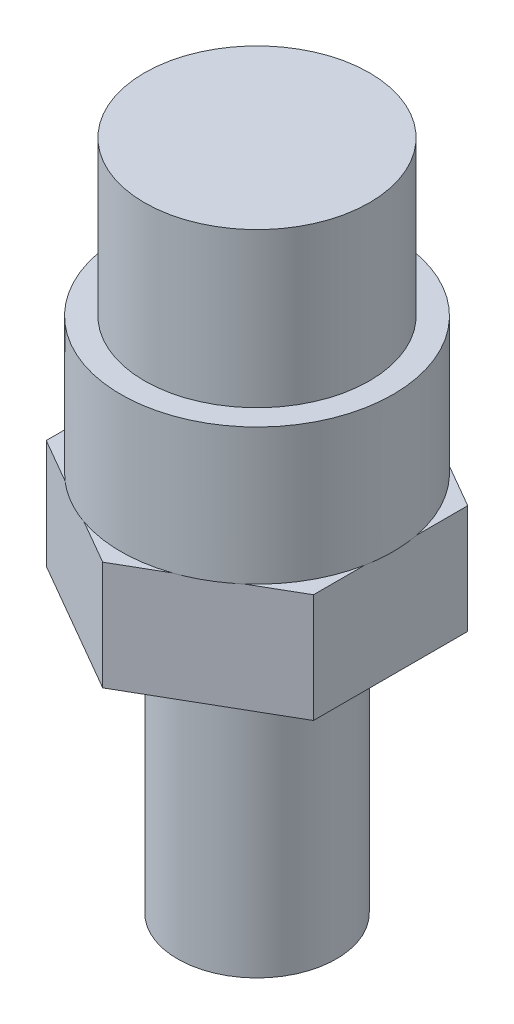
ISO-10303-21;
HEADER;
FILE_DESCRIPTION(('STEP AP214'),'2;1');
FILE_NAME('part.step','',(''),(''),'','','');
FILE_SCHEMA(('AUTOMOTIVE_DESIGN { 1 0 10303 214 1 1 1 1 }'));
ENDSEC;
DATA;
#1=APPLICATION_CONTEXT('core data for automotive mechanical design processes');
#2=APPLICATION_PROTOCOL_DEFINITION('international standard','automotive_design',2000,#1);
#3=PRODUCT_CONTEXT('',#1,'mechanical');
#4=PRODUCT('Part','Part','',(#3));
#5=PRODUCT_RELATED_PRODUCT_CATEGORY('part','',(#4));
#6=PRODUCT_DEFINITION_FORMATION('','',#4);
#7=PRODUCT_DEFINITION_CONTEXT('part definition',#1,'design');
#8=PRODUCT_DEFINITION('design','',#6,#7);
#9=PRODUCT_DEFINITION_SHAPE('','',#8);
#10=(LENGTH_UNIT() NAMED_UNIT(*) SI_UNIT(.MILLI.,.METRE.));
#11=(NAMED_UNIT(*) PLANE_ANGLE_UNIT() SI_UNIT($,.RADIAN.));
#12=(NAMED_UNIT(*) SI_UNIT($,.STERADIAN.) SOLID_ANGLE_UNIT());
#13=UNCERTAINTY_MEASURE_WITH_UNIT(LENGTH_MEASURE(1.E-05),#10,'distance_accuracy_value','');
#14=(GEOMETRIC_REPRESENTATION_CONTEXT(3) GLOBAL_UNCERTAINTY_ASSIGNED_CONTEXT((#13)) GLOBAL_UNIT_ASSIGNED_CONTEXT((#10,
#11,#12)) REPRESENTATION_CONTEXT('',''));
#15=CARTESIAN_POINT('',(0.,0.,0.));
#16=DIRECTION('',(0.,0.,1.));
#17=DIRECTION('',(1.,0.,0.));
#18=AXIS2_PLACEMENT_3D('',#15,#16,#17);
#19=CARTESIAN_POINT('',(5.55625000000001,19.05,0.));
#20=DIRECTION('',(0.,1.,0.));
#21=DIRECTION('',(-1.,0.,0.));
#22=AXIS2_PLACEMENT_3D('',#19,#20,#21);
#23=PLANE('',#22);
#24=CARTESIAN_POINT('',(0.,19.05,0.));
#25=DIRECTION('',(0.,1.,0.));
#26=DIRECTION('',(-1.,0.,0.));
#27=AXIS2_PLACEMENT_3D('',#24,#25,#26);
#28=CIRCLE('',#27,5.55625000000001);
#29=CARTESIAN_POINT('',(-5.55625000000001,19.05,0.));
#30=VERTEX_POINT('',#29);
#31=EDGE_CURVE('E68',#30,#30,#28,.T.);
#32=ORIENTED_EDGE('',*,*,#31,.T.);
#33=EDGE_LOOP('',(#32));
#34=FACE_BOUND('',#33,.T.);
#35=DIRECTION('',(0.,0.,-1.));
#36=VECTOR('',#35,1.);
#37=CARTESIAN_POINT('',(-9.34874423385302,19.05,0.));
#38=LINE('',#37,#36);
#39=CARTESIAN_POINT('',(-9.34874423385302,19.05,5.3975));
#40=VERTEX_POINT('',#39);
#41=CARTESIAN_POINT('',(-9.34874423385302,19.05,-5.3975));
#42=VERTEX_POINT('',#41);
#43=EDGE_CURVE('E150',#40,#42,#38,.T.);
#44=ORIENTED_EDGE('',*,*,#43,.T.);
#45=DIRECTION('',(0.866025403784439,0.,-0.5));
#46=VECTOR('',#45,1.);
#47=CARTESIAN_POINT('',(-4.67437211692651,19.05,-8.09625));
#48=LINE('',#47,#46);
#49=CARTESIAN_POINT('',(0.,19.05,-10.795));
#50=VERTEX_POINT('',#49);
#51=EDGE_CURVE('E351',#42,#50,#48,.T.);
#52=ORIENTED_EDGE('',*,*,#51,.T.);
#53=DIRECTION('',(0.866025403784439,0.,0.5));
#54=VECTOR('',#53,1.);
#55=CARTESIAN_POINT('',(4.67437211692651,19.05,-8.09625));
#56=LINE('',#55,#54);
#57=CARTESIAN_POINT('',(9.34874423385302,19.05,-5.39750000000001));
#58=VERTEX_POINT('',#57);
#59=EDGE_CURVE('E338',#50,#58,#56,.T.);
#60=ORIENTED_EDGE('',*,*,#59,.T.);
#61=DIRECTION('',(0.,0.,1.));
#62=VECTOR('',#61,1.);
#63=CARTESIAN_POINT('',(9.34874423385302,19.05,0.));
#64=LINE('',#63,#62);
#65=CARTESIAN_POINT('',(9.34874423385302,19.05,5.39750000000001));
#66=VERTEX_POINT('',#65);
#67=EDGE_CURVE('E323',#58,#66,#64,.T.);
#68=ORIENTED_EDGE('',*,*,#67,.T.);
#69=DIRECTION('',(-0.866025403784439,0.,0.5));
#70=VECTOR('',#69,1.);
#71=CARTESIAN_POINT('',(4.67437211692651,19.05,8.09625));
#72=LINE('',#71,#70);
#73=CARTESIAN_POINT('',(0.,19.05,10.795));
#74=VERTEX_POINT('',#73);
#75=EDGE_CURVE('E178',#66,#74,#72,.T.);
#76=ORIENTED_EDGE('',*,*,#75,.T.);
#77=DIRECTION('',(-0.866025403784439,0.,-0.5));
#78=VECTOR('',#77,1.);
#79=CARTESIAN_POINT('',(-4.67437211692651,19.05,8.09625));
#80=LINE('',#79,#78);
#81=EDGE_CURVE('E169',#74,#40,#80,.T.);
#82=ORIENTED_EDGE('',*,*,#81,.T.);
#83=EDGE_LOOP('',(#44,#52,#60,#68,#76,#82));
#84=FACE_BOUND('',#83,.T.);
#85=ADVANCED_FACE('F60',(#34,#84),#23,.F.);
#86=CARTESIAN_POINT('',(10.795,26.67,0.));
#87=DIRECTION('',(0.,-1.,0.));
#88=DIRECTION('',(1.,0.,0.));
#89=AXIS2_PLACEMENT_3D('',#86,#87,#88);
#90=PLANE('',#89);
#91=DIRECTION('',(0.,0.,1.));
#92=VECTOR('',#91,1.);
#93=CARTESIAN_POINT('',(-9.34874423385302,26.67,0.));
#94=LINE('',#93,#92);
#95=CARTESIAN_POINT('',(-9.34874423385302,26.67,1.82389864027584));
#96=VERTEX_POINT('',#95);
#97=CARTESIAN_POINT('',(-9.34874423385302,26.67,5.3975));
#98=VERTEX_POINT('',#97);
#99=EDGE_CURVE('E290',#96,#98,#94,.T.);
#100=ORIENTED_EDGE('',*,*,#99,.T.);
#101=DIRECTION('',(0.866025403784439,0.,0.5));
#102=VECTOR('',#101,1.);
#103=CARTESIAN_POINT('',(-4.67437211692651,26.67,8.09625));
#104=LINE('',#103,#102);
#105=CARTESIAN_POINT('',(-6.25391467333327,26.67,7.1843006798621));
#106=VERTEX_POINT('',#105);
#107=EDGE_CURVE('E171',#98,#106,#104,.T.);
#108=ORIENTED_EDGE('',*,*,#107,.T.);
#109=CARTESIAN_POINT('',(0.,26.67,0.));
#110=DIRECTION('',(0.,1.,0.));
#111=DIRECTION('',(-1.,0.,0.));
#112=AXIS2_PLACEMENT_3D('',#109,#110,#111);
#113=CIRCLE('',#112,9.52500000000001);
#114=EDGE_CURVE('E82',#96,#106,#113,.T.);
#115=ORIENTED_EDGE('',*,*,#114,.F.);
#116=EDGE_LOOP('',(#100,#108,#115));
#117=FACE_BOUND('',#116,.T.);
#118=ADVANCED_FACE('F215',(#117),#90,.F.);
#119=CARTESIAN_POINT('',(-9.34874423385302,26.67,-5.3975));
#120=VERTEX_POINT('',#119);
#121=CARTESIAN_POINT('',(-9.34874423385302,26.67,-1.82389864027585));
#122=VERTEX_POINT('',#121);
#123=EDGE_CURVE('E162',#120,#122,#94,.T.);
#124=ORIENTED_EDGE('',*,*,#123,.T.);
#125=CARTESIAN_POINT('',(-6.25391467333327,26.67,-7.1843006798621));
#126=VERTEX_POINT('',#125);
#127=EDGE_CURVE('E288',#126,#122,#113,.T.);
#128=ORIENTED_EDGE('',*,*,#127,.F.);
#129=DIRECTION('',(-0.866025403784439,0.,0.5));
#130=VECTOR('',#129,1.);
#131=CARTESIAN_POINT('',(-4.67437211692651,26.67,-8.09625));
#132=LINE('',#131,#130);
#133=EDGE_CURVE('E161',#126,#120,#132,.T.);
#134=ORIENTED_EDGE('',*,*,#133,.T.);
#135=EDGE_LOOP('',(#124,#128,#134));
#136=FACE_BOUND('',#135,.T.);
#137=ADVANCED_FACE('F221',(#136),#90,.F.);
#138=CARTESIAN_POINT('',(0.,26.67,-10.795));
#139=VERTEX_POINT('',#138);
#140=CARTESIAN_POINT('',(-3.09482956051975,26.67,-9.00819932013792));
#141=VERTEX_POINT('',#140);
#142=EDGE_CURVE('E355',#139,#141,#132,.T.);
#143=ORIENTED_EDGE('',*,*,#142,.T.);
#144=CARTESIAN_POINT('',(3.09482956051974,26.67,-9.00819932013792));
#145=VERTEX_POINT('',#144);
#146=EDGE_CURVE('E298',#145,#141,#113,.T.);
#147=ORIENTED_EDGE('',*,*,#146,.F.);
#148=DIRECTION('',(-0.866025403784439,0.,-0.5));
#149=VECTOR('',#148,1.);
#150=CARTESIAN_POINT('',(4.67437211692651,26.67,-8.09625));
#151=LINE('',#150,#149);
#152=EDGE_CURVE('E348',#145,#139,#151,.T.);
#153=ORIENTED_EDGE('',*,*,#152,.T.);
#154=EDGE_LOOP('',(#143,#147,#153));
#155=FACE_BOUND('',#154,.T.);
#156=ADVANCED_FACE('F370',(#155),#90,.F.);
#157=CARTESIAN_POINT('',(9.34874423385302,26.67,-5.39750000000001));
#158=VERTEX_POINT('',#157);
#159=CARTESIAN_POINT('',(6.25391467333328,26.67,-7.18430067986209));
#160=VERTEX_POINT('',#159);
#161=EDGE_CURVE('E344',#158,#160,#151,.T.);
#162=ORIENTED_EDGE('',*,*,#161,.T.);
#163=CARTESIAN_POINT('',(9.34874423385302,26.67,-1.82389864027583));
#164=VERTEX_POINT('',#163);
#165=EDGE_CURVE('E302',#164,#160,#113,.T.);
#166=ORIENTED_EDGE('',*,*,#165,.F.);
#167=DIRECTION('',(0.,0.,-1.));
#168=VECTOR('',#167,1.);
#169=CARTESIAN_POINT('',(9.34874423385302,26.67,0.));
#170=LINE('',#169,#168);
#171=EDGE_CURVE('E335',#164,#158,#170,.T.);
#172=ORIENTED_EDGE('',*,*,#171,.T.);
#173=EDGE_LOOP('',(#162,#166,#172));
#174=FACE_BOUND('',#173,.T.);
#175=ADVANCED_FACE('F366',(#174),#90,.F.);
#176=CARTESIAN_POINT('',(9.34874423385301,26.67,5.39750000000001));
#177=VERTEX_POINT('',#176);
#178=CARTESIAN_POINT('',(9.34874423385302,26.67,1.82389864027584));
#179=VERTEX_POINT('',#178);
#180=EDGE_CURVE('E330',#177,#179,#170,.T.);
#181=ORIENTED_EDGE('',*,*,#180,.T.);
#182=CARTESIAN_POINT('',(6.25391467333327,26.67,7.18430067986209));
#183=VERTEX_POINT('',#182);
#184=EDGE_CURVE('E307',#183,#179,#113,.T.);
#185=ORIENTED_EDGE('',*,*,#184,.F.);
#186=DIRECTION('',(0.866025403784439,0.,-0.5));
#187=VECTOR('',#186,1.);
#188=CARTESIAN_POINT('',(4.67437211692651,26.67,8.09625));
#189=LINE('',#188,#187);
#190=EDGE_CURVE('E319',#183,#177,#189,.T.);
#191=ORIENTED_EDGE('',*,*,#190,.T.);
#192=EDGE_LOOP('',(#181,#185,#191));
#193=FACE_BOUND('',#192,.T.);
#194=ADVANCED_FACE('F212',(#193),#90,.F.);
#195=CARTESIAN_POINT('',(0.,26.67,10.795));
#196=VERTEX_POINT('',#195);
#197=CARTESIAN_POINT('',(3.09482956051974,26.67,9.00819932013792));
#198=VERTEX_POINT('',#197);
#199=EDGE_CURVE('E316',#196,#198,#189,.T.);
#200=ORIENTED_EDGE('',*,*,#199,.T.);
#201=CARTESIAN_POINT('',(-3.09482956051975,26.67,9.00819932013792));
#202=VERTEX_POINT('',#201);
#203=EDGE_CURVE('E196',#202,#198,#113,.T.);
#204=ORIENTED_EDGE('',*,*,#203,.F.);
#205=EDGE_CURVE('E172',#202,#196,#104,.T.);
#206=ORIENTED_EDGE('',*,*,#205,.T.);
#207=EDGE_LOOP('',(#200,#204,#206));
#208=FACE_BOUND('',#207,.T.);
#209=ADVANCED_FACE('F208',(#208),#90,.F.);
#210=CARTESIAN_POINT('',(0.,0.,0.));
#211=DIRECTION('',(0.,1.,0.));
#212=DIRECTION('',(-1.,0.,0.));
#213=AXIS2_PLACEMENT_3D('',#210,#211,#212);
#214=PLANE('',#213);
#215=CARTESIAN_POINT('',(0.,0.,0.));
#216=DIRECTION('',(0.,1.,0.));
#217=DIRECTION('',(-1.,0.,0.));
#218=AXIS2_PLACEMENT_3D('',#215,#216,#217);
#219=CIRCLE('',#218,5.55625000000001);
#220=CARTESIAN_POINT('',(-5.55625000000001,0.,0.));
#221=VERTEX_POINT('',#220);
#222=EDGE_CURVE('E12',#221,#221,#219,.T.);
#223=ORIENTED_EDGE('',*,*,#222,.F.);
#224=EDGE_LOOP('',(#223));
#225=FACE_BOUND('',#224,.T.);
#226=ADVANCED_FACE('F62',(#225),#214,.F.);
#227=CARTESIAN_POINT('',(0.,46.99,0.));
#228=DIRECTION('',(0.,1.,0.));
#229=DIRECTION('',(-1.,0.,0.));
#230=AXIS2_PLACEMENT_3D('',#227,#228,#229);
#231=CYLINDRICAL_SURFACE('',#230,5.55625000000001);
#232=ORIENTED_EDGE('',*,*,#31,.F.);
#233=EDGE_LOOP('',(#232));
#234=FACE_BOUND('',#233,.T.);
#235=ORIENTED_EDGE('',*,*,#222,.T.);
#236=EDGE_LOOP('',(#235));
#237=FACE_BOUND('',#236,.T.);
#238=ADVANCED_FACE('F201',(#234,#237),#231,.T.);
#239=CARTESIAN_POINT('',(0.,46.99,0.));
#240=DIRECTION('',(0.,1.,0.));
#241=DIRECTION('',(-1.,0.,0.));
#242=AXIS2_PLACEMENT_3D('',#239,#240,#241);
#243=CYLINDRICAL_SURFACE('',#242,9.52500000000001);
#244=CARTESIAN_POINT('',(0.,36.195,0.));
#245=DIRECTION('',(0.,1.,0.));
#246=DIRECTION('',(-1.,0.,0.));
#247=AXIS2_PLACEMENT_3D('',#244,#245,#246);
#248=CIRCLE('',#247,9.52500000000001);
#249=CARTESIAN_POINT('',(-9.52500000000001,36.195,0.));
#250=VERTEX_POINT('',#249);
#251=EDGE_CURVE('E192',#250,#250,#248,.T.);
#252=ORIENTED_EDGE('',*,*,#251,.F.);
#253=EDGE_LOOP('',(#252));
#254=FACE_BOUND('',#253,.T.);
#255=EDGE_CURVE('E195',#106,#202,#113,.T.);
#256=ORIENTED_EDGE('',*,*,#255,.T.);
#257=ORIENTED_EDGE('',*,*,#203,.T.);
#258=EDGE_CURVE('E309',#198,#183,#113,.T.);
#259=ORIENTED_EDGE('',*,*,#258,.T.);
#260=ORIENTED_EDGE('',*,*,#184,.T.);
#261=EDGE_CURVE('E304',#179,#164,#113,.T.);
#262=ORIENTED_EDGE('',*,*,#261,.T.);
#263=ORIENTED_EDGE('',*,*,#165,.T.);
#264=EDGE_CURVE('E299',#160,#145,#113,.T.);
#265=ORIENTED_EDGE('',*,*,#264,.T.);
#266=ORIENTED_EDGE('',*,*,#146,.T.);
#267=EDGE_CURVE('E297',#141,#126,#113,.T.);
#268=ORIENTED_EDGE('',*,*,#267,.T.);
#269=ORIENTED_EDGE('',*,*,#127,.T.);
#270=EDGE_CURVE('E284',#122,#96,#113,.T.);
#271=ORIENTED_EDGE('',*,*,#270,.T.);
#272=ORIENTED_EDGE('',*,*,#114,.T.);
#273=EDGE_LOOP('',(#256,#257,#259,#260,#262,#263,#265,#266,#268,#269,#271,#272));
#274=FACE_BOUND('',#273,.T.);
#275=ADVANCED_FACE('F204',(#254,#274),#243,.T.);
#276=CARTESIAN_POINT('',(9.525,36.195,0.));
#277=DIRECTION('',(0.,-1.,0.));
#278=DIRECTION('',(1.,0.,0.));
#279=AXIS2_PLACEMENT_3D('',#276,#277,#278);
#280=PLANE('',#279);
#281=CARTESIAN_POINT('',(0.,36.195,0.));
#282=DIRECTION('',(0.,1.,0.));
#283=DIRECTION('',(-1.,0.,0.));
#284=AXIS2_PLACEMENT_3D('',#281,#282,#283);
#285=CIRCLE('',#284,7.874);
#286=CARTESIAN_POINT('',(-7.874,36.195,0.));
#287=VERTEX_POINT('',#286);
#288=EDGE_CURVE('E189',#287,#287,#285,.T.);
#289=ORIENTED_EDGE('',*,*,#288,.F.);
#290=EDGE_LOOP('',(#289));
#291=FACE_BOUND('',#290,.T.);
#292=ORIENTED_EDGE('',*,*,#251,.T.);
#293=EDGE_LOOP('',(#292));
#294=FACE_BOUND('',#293,.T.);
#295=ADVANCED_FACE('F226',(#291,#294),#280,.F.);
#296=CARTESIAN_POINT('',(0.,46.99,0.));
#297=DIRECTION('',(0.,1.,0.));
#298=DIRECTION('',(-1.,0.,0.));
#299=AXIS2_PLACEMENT_3D('',#296,#297,#298);
#300=CYLINDRICAL_SURFACE('',#299,7.874);
#301=CARTESIAN_POINT('',(0.,46.99,0.));
#302=DIRECTION('',(0.,1.,0.));
#303=DIRECTION('',(-1.,0.,0.));
#304=AXIS2_PLACEMENT_3D('',#301,#302,#303);
#305=CIRCLE('',#304,7.874);
#306=CARTESIAN_POINT('',(-7.874,46.99,0.));
#307=VERTEX_POINT('',#306);
#308=EDGE_CURVE('E186',#307,#307,#305,.T.);
#309=ORIENTED_EDGE('',*,*,#308,.F.);
#310=EDGE_LOOP('',(#309));
#311=FACE_BOUND('',#310,.T.);
#312=ORIENTED_EDGE('',*,*,#288,.T.);
#313=EDGE_LOOP('',(#312));
#314=FACE_BOUND('',#313,.T.);
#315=ADVANCED_FACE('F230',(#311,#314),#300,.T.);
#316=CARTESIAN_POINT('',(7.874,46.99,0.));
#317=DIRECTION('',(0.,-1.,0.));
#318=DIRECTION('',(1.,0.,0.));
#319=AXIS2_PLACEMENT_3D('',#316,#317,#318);
#320=PLANE('',#319);
#321=ORIENTED_EDGE('',*,*,#308,.T.);
#322=EDGE_LOOP('',(#321));
#323=FACE_BOUND('',#322,.T.);
#324=ADVANCED_FACE('F234',(#323),#320,.F.);
#325=CARTESIAN_POINT('',(10.795,26.67,0.));
#326=DIRECTION('',(0.,-1.,0.));
#327=DIRECTION('',(1.,0.,0.));
#328=AXIS2_PLACEMENT_3D('',#325,#326,#327);
#329=PLANE('',#328);
#330=ORIENTED_EDGE('',*,*,#255,.F.);
#331=EDGE_CURVE('E74',#106,#202,#104,.T.);
#332=ORIENTED_EDGE('',*,*,#331,.T.);
#333=EDGE_LOOP('',(#330,#332));
#334=FACE_BOUND('',#333,.T.);
#335=ADVANCED_FACE('F238',(#334),#329,.T.);
#336=CARTESIAN_POINT('',(-4.67437211692651,37.5614498915945,8.09625));
#337=DIRECTION('',(-0.5,0.,0.866025403784439));
#338=DIRECTION('',(0.866025403784439,0.,0.5));
#339=AXIS2_PLACEMENT_3D('',#336,#337,#338);
#340=PLANE('',#339);
#341=DIRECTION('',(0.,-1.,0.));
#342=VECTOR('',#341,1.);
#343=CARTESIAN_POINT('',(-9.34874423385302,37.5614498915945,5.3975));
#344=LINE('',#343,#342);
#345=EDGE_CURVE('E153',#98,#40,#344,.T.);
#346=ORIENTED_EDGE('',*,*,#345,.T.);
#347=ORIENTED_EDGE('',*,*,#81,.F.);
#348=DIRECTION('',(0.,-1.,0.));
#349=VECTOR('',#348,1.);
#350=CARTESIAN_POINT('',(0.,37.5614498915945,10.795));
#351=LINE('',#350,#349);
#352=EDGE_CURVE('E173',#196,#74,#351,.T.);
#353=ORIENTED_EDGE('',*,*,#352,.F.);
#354=ORIENTED_EDGE('',*,*,#205,.F.);
#355=ORIENTED_EDGE('',*,*,#331,.F.);
#356=ORIENTED_EDGE('',*,*,#107,.F.);
#357=EDGE_LOOP('',(#346,#347,#353,#354,#355,#356));
#358=FACE_BOUND('',#357,.T.);
#359=ADVANCED_FACE('F167',(#358),#340,.T.);
#360=CARTESIAN_POINT('',(10.795,26.67,0.));
#361=DIRECTION('',(0.,-1.,0.));
#362=DIRECTION('',(1.,0.,0.));
#363=AXIS2_PLACEMENT_3D('',#360,#361,#362);
#364=PLANE('',#363);
#365=ORIENTED_EDGE('',*,*,#258,.F.);
#366=EDGE_CURVE('E318',#198,#183,#189,.T.);
#367=ORIENTED_EDGE('',*,*,#366,.T.);
#368=EDGE_LOOP('',(#365,#367));
#369=FACE_BOUND('',#368,.T.);
#370=ADVANCED_FACE('F242',(#369),#364,.T.);
#371=CARTESIAN_POINT('',(4.67437211692651,37.5614498915945,8.09625));
#372=DIRECTION('',(0.5,0.,0.866025403784439));
#373=DIRECTION('',(0.866025403784439,0.,-0.5));
#374=AXIS2_PLACEMENT_3D('',#371,#372,#373);
#375=PLANE('',#374);
#376=ORIENTED_EDGE('',*,*,#352,.T.);
#377=ORIENTED_EDGE('',*,*,#75,.F.);
#378=DIRECTION('',(0.,-1.,0.));
#379=VECTOR('',#378,1.);
#380=CARTESIAN_POINT('',(9.34874423385302,37.5614498915945,5.39750000000001));
#381=LINE('',#380,#379);
#382=EDGE_CURVE('E181',#177,#66,#381,.T.);
#383=ORIENTED_EDGE('',*,*,#382,.F.);
#384=ORIENTED_EDGE('',*,*,#190,.F.);
#385=ORIENTED_EDGE('',*,*,#366,.F.);
#386=ORIENTED_EDGE('',*,*,#199,.F.);
#387=EDGE_LOOP('',(#376,#377,#383,#384,#385,#386));
#388=FACE_BOUND('',#387,.T.);
#389=ADVANCED_FACE('F247',(#388),#375,.T.);
#390=CARTESIAN_POINT('',(10.795,26.67,0.));
#391=DIRECTION('',(0.,-1.,0.));
#392=DIRECTION('',(1.,0.,0.));
#393=AXIS2_PLACEMENT_3D('',#390,#391,#392);
#394=PLANE('',#393);
#395=ORIENTED_EDGE('',*,*,#261,.F.);
#396=EDGE_CURVE('E334',#179,#164,#170,.T.);
#397=ORIENTED_EDGE('',*,*,#396,.T.);
#398=EDGE_LOOP('',(#395,#397));
#399=FACE_BOUND('',#398,.T.);
#400=ADVANCED_FACE('F251',(#399),#394,.T.);
#401=CARTESIAN_POINT('',(9.34874423385302,37.5614498915945,0.));
#402=DIRECTION('',(1.,0.,0.));
#403=DIRECTION('',(0.,0.,-1.));
#404=AXIS2_PLACEMENT_3D('',#401,#402,#403);
#405=PLANE('',#404);
#406=ORIENTED_EDGE('',*,*,#382,.T.);
#407=ORIENTED_EDGE('',*,*,#67,.F.);
#408=DIRECTION('',(0.,-1.,0.));
#409=VECTOR('',#408,1.);
#410=CARTESIAN_POINT('',(9.34874423385302,37.5614498915945,-5.39750000000001));
#411=LINE('',#410,#409);
#412=EDGE_CURVE('E326',#158,#58,#411,.T.);
#413=ORIENTED_EDGE('',*,*,#412,.F.);
#414=ORIENTED_EDGE('',*,*,#171,.F.);
#415=ORIENTED_EDGE('',*,*,#396,.F.);
#416=ORIENTED_EDGE('',*,*,#180,.F.);
#417=EDGE_LOOP('',(#406,#407,#413,#414,#415,#416));
#418=FACE_BOUND('',#417,.T.);
#419=ADVANCED_FACE('F255',(#418),#405,.T.);
#420=CARTESIAN_POINT('',(10.795,26.67,0.));
#421=DIRECTION('',(0.,-1.,0.));
#422=DIRECTION('',(1.,0.,0.));
#423=AXIS2_PLACEMENT_3D('',#420,#421,#422);
#424=PLANE('',#423);
#425=ORIENTED_EDGE('',*,*,#264,.F.);
#426=EDGE_CURVE('E347',#160,#145,#151,.T.);
#427=ORIENTED_EDGE('',*,*,#426,.T.);
#428=EDGE_LOOP('',(#425,#427));
#429=FACE_BOUND('',#428,.T.);
#430=ADVANCED_FACE('F259',(#429),#424,.T.);
#431=CARTESIAN_POINT('',(4.67437211692651,37.5614498915945,-8.09625));
#432=DIRECTION('',(0.5,0.,-0.866025403784439));
#433=DIRECTION('',(-0.866025403784439,0.,-0.5));
#434=AXIS2_PLACEMENT_3D('',#431,#432,#433);
#435=PLANE('',#434);
#436=ORIENTED_EDGE('',*,*,#412,.T.);
#437=ORIENTED_EDGE('',*,*,#59,.F.);
#438=DIRECTION('',(0.,-1.,0.));
#439=VECTOR('',#438,1.);
#440=CARTESIAN_POINT('',(0.,37.5614498915945,-10.795));
#441=LINE('',#440,#439);
#442=EDGE_CURVE('E341',#139,#50,#441,.T.);
#443=ORIENTED_EDGE('',*,*,#442,.F.);
#444=ORIENTED_EDGE('',*,*,#152,.F.);
#445=ORIENTED_EDGE('',*,*,#426,.F.);
#446=ORIENTED_EDGE('',*,*,#161,.F.);
#447=EDGE_LOOP('',(#436,#437,#443,#444,#445,#446));
#448=FACE_BOUND('',#447,.T.);
#449=ADVANCED_FACE('F263',(#448),#435,.T.);
#450=CARTESIAN_POINT('',(10.795,26.67,0.));
#451=DIRECTION('',(0.,-1.,0.));
#452=DIRECTION('',(1.,0.,0.));
#453=AXIS2_PLACEMENT_3D('',#450,#451,#452);
#454=PLANE('',#453);
#455=ORIENTED_EDGE('',*,*,#267,.F.);
#456=EDGE_CURVE('E357',#141,#126,#132,.T.);
#457=ORIENTED_EDGE('',*,*,#456,.T.);
#458=EDGE_LOOP('',(#455,#457));
#459=FACE_BOUND('',#458,.T.);
#460=ADVANCED_FACE('F267',(#459),#454,.T.);
#461=CARTESIAN_POINT('',(-4.67437211692651,37.5614498915945,-8.09625));
#462=DIRECTION('',(-0.5,0.,-0.866025403784439));
#463=DIRECTION('',(-0.866025403784439,0.,0.5));
#464=AXIS2_PLACEMENT_3D('',#461,#462,#463);
#465=PLANE('',#464);
#466=ORIENTED_EDGE('',*,*,#442,.T.);
#467=ORIENTED_EDGE('',*,*,#51,.F.);
#468=DIRECTION('',(0.,-1.,0.));
#469=VECTOR('',#468,1.);
#470=CARTESIAN_POINT('',(-9.34874423385302,37.5614498915945,-5.3975));
#471=LINE('',#470,#469);
#472=EDGE_CURVE('E156',#120,#42,#471,.T.);
#473=ORIENTED_EDGE('',*,*,#472,.F.);
#474=ORIENTED_EDGE('',*,*,#133,.F.);
#475=ORIENTED_EDGE('',*,*,#456,.F.);
#476=ORIENTED_EDGE('',*,*,#142,.F.);
#477=EDGE_LOOP('',(#466,#467,#473,#474,#475,#476));
#478=FACE_BOUND('',#477,.T.);
#479=ADVANCED_FACE('F271',(#478),#465,.T.);
#480=CARTESIAN_POINT('',(10.795,26.67,0.));
#481=DIRECTION('',(0.,-1.,0.));
#482=DIRECTION('',(1.,0.,0.));
#483=AXIS2_PLACEMENT_3D('',#480,#481,#482);
#484=PLANE('',#483);
#485=ORIENTED_EDGE('',*,*,#270,.F.);
#486=EDGE_CURVE('E286',#122,#96,#94,.T.);
#487=ORIENTED_EDGE('',*,*,#486,.T.);
#488=EDGE_LOOP('',(#485,#487));
#489=FACE_BOUND('',#488,.T.);
#490=ADVANCED_FACE('F275',(#489),#484,.T.);
#491=CARTESIAN_POINT('',(-9.34874423385302,37.5614498915945,0.));
#492=DIRECTION('',(-1.,0.,0.));
#493=DIRECTION('',(0.,0.,1.));
#494=AXIS2_PLACEMENT_3D('',#491,#492,#493);
#495=PLANE('',#494);
#496=ORIENTED_EDGE('',*,*,#472,.T.);
#497=ORIENTED_EDGE('',*,*,#43,.F.);
#498=ORIENTED_EDGE('',*,*,#345,.F.);
#499=ORIENTED_EDGE('',*,*,#99,.F.);
#500=ORIENTED_EDGE('',*,*,#486,.F.);
#501=ORIENTED_EDGE('',*,*,#123,.F.);
#502=EDGE_LOOP('',(#496,#497,#498,#499,#500,#501));
#503=FACE_BOUND('',#502,.T.);
#504=ADVANCED_FACE('F152',(#503),#495,.T.);
#505=CLOSED_SHELL('',(#85,#118,#137,#156,#175,#194,#209,#226,#238,#275,#295,#315,#324,#335,#359,
#370,#389,#400,#419,#430,#449,#460,#479,#490,#504));
#506=MANIFOLD_SOLID_BREP('B2',#505);
#507=ADVANCED_BREP_SHAPE_REPRESENTATION('',(#18,#506),#14);
#508=SHAPE_DEFINITION_REPRESENTATION(#9,#507);
ENDSEC;
END-ISO-10303-21;
